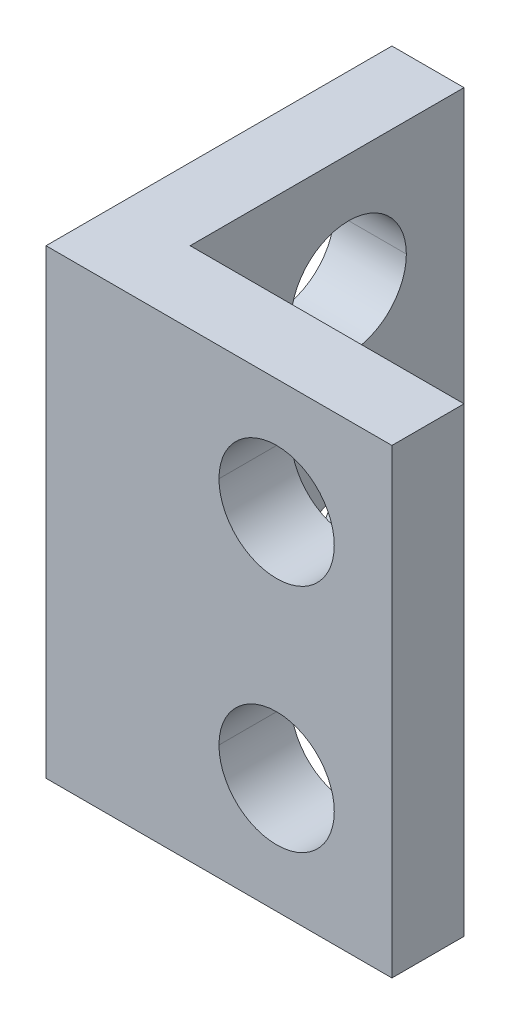
ISO-10303-21;
HEADER;
FILE_DESCRIPTION(('STEP AP214'),'2;1');
FILE_NAME('part.step','',(''),(''),'','','');
FILE_SCHEMA(('AUTOMOTIVE_DESIGN { 1 0 10303 214 1 1 1 1 }'));
ENDSEC;
DATA;
#1=APPLICATION_CONTEXT('core data for automotive mechanical design processes');
#2=APPLICATION_PROTOCOL_DEFINITION('international standard','automotive_design',2000,#1);
#3=PRODUCT_CONTEXT('',#1,'mechanical');
#4=PRODUCT('Part','Part','',(#3));
#5=PRODUCT_RELATED_PRODUCT_CATEGORY('part','',(#4));
#6=PRODUCT_DEFINITION_FORMATION('','',#4);
#7=PRODUCT_DEFINITION_CONTEXT('part definition',#1,'design');
#8=PRODUCT_DEFINITION('design','',#6,#7);
#9=PRODUCT_DEFINITION_SHAPE('','',#8);
#10=(LENGTH_UNIT() NAMED_UNIT(*) SI_UNIT(.MILLI.,.METRE.));
#11=(NAMED_UNIT(*) PLANE_ANGLE_UNIT() SI_UNIT($,.RADIAN.));
#12=(NAMED_UNIT(*) SI_UNIT($,.STERADIAN.) SOLID_ANGLE_UNIT());
#13=UNCERTAINTY_MEASURE_WITH_UNIT(LENGTH_MEASURE(1.E-05),#10,'distance_accuracy_value','');
#14=(GEOMETRIC_REPRESENTATION_CONTEXT(3) GLOBAL_UNCERTAINTY_ASSIGNED_CONTEXT((#13)) GLOBAL_UNIT_ASSIGNED_CONTEXT((#10,
#11,#12)) REPRESENTATION_CONTEXT('',''));
#15=CARTESIAN_POINT('',(0.,0.,0.));
#16=DIRECTION('',(0.,0.,1.));
#17=DIRECTION('',(1.,0.,0.));
#18=AXIS2_PLACEMENT_3D('',#15,#16,#17);
#19=CARTESIAN_POINT('',(12.,12.,-8.));
#20=DIRECTION('',(-1.,0.,0.));
#21=DIRECTION('',(0.,0.,1.));
#22=AXIS2_PLACEMENT_3D('',#19,#20,#21);
#23=CYLINDRICAL_SURFACE('',#22,2.);
#24=DIRECTION('',(-1.,0.,0.));
#25=VECTOR('',#24,1.);
#26=CARTESIAN_POINT('',(12.,12.,-10.));
#27=LINE('',#26,#25);
#28=CARTESIAN_POINT('',(2.5,12.,-10.));
#29=VERTEX_POINT('',#28);
#30=CARTESIAN_POINT('',(0.,12.,-10.));
#31=VERTEX_POINT('',#30);
#32=EDGE_CURVE('E214',#29,#31,#27,.T.);
#33=ORIENTED_EDGE('',*,*,#32,.F.);
#34=CARTESIAN_POINT('',(2.5,12.,-8.));
#35=DIRECTION('',(-1.,0.,0.));
#36=DIRECTION('',(0.,0.,1.));
#37=AXIS2_PLACEMENT_3D('',#34,#35,#36);
#38=CIRCLE('',#37,2.);
#39=CARTESIAN_POINT('',(2.5,12.,-6.));
#40=VERTEX_POINT('',#39);
#41=EDGE_CURVE('E83',#40,#29,#38,.T.);
#42=ORIENTED_EDGE('',*,*,#41,.F.);
#43=DIRECTION('',(-1.,0.,0.));
#44=VECTOR('',#43,1.);
#45=CARTESIAN_POINT('',(12.,12.,-6.));
#46=LINE('',#45,#44);
#47=CARTESIAN_POINT('',(0.,12.,-6.));
#48=VERTEX_POINT('',#47);
#49=EDGE_CURVE('E236',#40,#48,#46,.T.);
#50=ORIENTED_EDGE('',*,*,#49,.T.);
#51=CARTESIAN_POINT('',(0.,12.,-8.));
#52=DIRECTION('',(-1.,0.,0.));
#53=DIRECTION('',(0.,0.,1.));
#54=AXIS2_PLACEMENT_3D('',#51,#52,#53);
#55=CIRCLE('',#54,2.);
#56=EDGE_CURVE('E180',#48,#31,#55,.T.);
#57=ORIENTED_EDGE('',*,*,#56,.T.);
#58=EDGE_LOOP('',(#33,#42,#50,#57));
#59=FACE_BOUND('',#58,.T.);
#60=ADVANCED_FACE('F15',(#59),#23,.F.);
#61=CARTESIAN_POINT('',(8.,12.,-12.));
#62=DIRECTION('',(0.,0.,1.));
#63=DIRECTION('',(1.,0.,0.));
#64=AXIS2_PLACEMENT_3D('',#61,#62,#63);
#65=CYLINDRICAL_SURFACE('',#64,2.);
#66=DIRECTION('',(0.,0.,1.));
#67=VECTOR('',#66,1.);
#68=CARTESIAN_POINT('',(6.,12.,-12.));
#69=LINE('',#68,#67);
#70=CARTESIAN_POINT('',(6.,12.,-2.5));
#71=VERTEX_POINT('',#70);
#72=CARTESIAN_POINT('',(6.,12.,0.));
#73=VERTEX_POINT('',#72);
#74=EDGE_CURVE('E206',#71,#73,#69,.T.);
#75=ORIENTED_EDGE('',*,*,#74,.F.);
#76=CARTESIAN_POINT('',(8.,12.,-2.5));
#77=DIRECTION('',(0.,0.,1.));
#78=DIRECTION('',(-1.,0.,0.));
#79=AXIS2_PLACEMENT_3D('',#76,#77,#78);
#80=CIRCLE('',#79,2.);
#81=CARTESIAN_POINT('',(10.,12.,-2.50000000000004));
#82=VERTEX_POINT('',#81);
#83=EDGE_CURVE('E246',#82,#71,#80,.T.);
#84=ORIENTED_EDGE('',*,*,#83,.F.);
#85=DIRECTION('',(0.,0.,1.));
#86=VECTOR('',#85,1.);
#87=CARTESIAN_POINT('',(10.,12.,-12.));
#88=LINE('',#87,#86);
#89=CARTESIAN_POINT('',(10.,12.,0.));
#90=VERTEX_POINT('',#89);
#91=EDGE_CURVE('E249',#82,#90,#88,.T.);
#92=ORIENTED_EDGE('',*,*,#91,.T.);
#93=CARTESIAN_POINT('',(8.,12.,0.));
#94=DIRECTION('',(0.,0.,-1.));
#95=DIRECTION('',(-1.,0.,0.));
#96=AXIS2_PLACEMENT_3D('',#93,#94,#95);
#97=CIRCLE('',#96,2.);
#98=EDGE_CURVE('E228',#73,#90,#97,.T.);
#99=ORIENTED_EDGE('',*,*,#98,.F.);
#100=EDGE_LOOP('',(#75,#84,#92,#99));
#101=FACE_BOUND('',#100,.T.);
#102=ADVANCED_FACE('F491',(#101),#65,.F.);
#103=CARTESIAN_POINT('',(0.,16.,0.));
#104=DIRECTION('',(0.,1.,0.));
#105=DIRECTION('',(1.,0.,0.));
#106=AXIS2_PLACEMENT_3D('',#103,#104,#105);
#107=PLANE('',#106);
#108=DIRECTION('',(1.,0.,0.));
#109=VECTOR('',#108,1.);
#110=CARTESIAN_POINT('',(0.,16.,-2.5));
#111=LINE('',#110,#109);
#112=CARTESIAN_POINT('',(2.5,16.,-2.5));
#113=VERTEX_POINT('',#112);
#114=CARTESIAN_POINT('',(12.,16.,-2.50000000000005));
#115=VERTEX_POINT('',#114);
#116=EDGE_CURVE('E242',#113,#115,#111,.T.);
#117=ORIENTED_EDGE('',*,*,#116,.F.);
#118=DIRECTION('',(0.,0.,-1.));
#119=VECTOR('',#118,1.);
#120=CARTESIAN_POINT('',(2.5,16.,0.));
#121=LINE('',#120,#119);
#122=CARTESIAN_POINT('',(2.5,16.,-12.));
#123=VERTEX_POINT('',#122);
#124=EDGE_CURVE('E255',#113,#123,#121,.T.);
#125=ORIENTED_EDGE('',*,*,#124,.T.);
#126=DIRECTION('',(1.,0.,0.));
#127=VECTOR('',#126,1.);
#128=CARTESIAN_POINT('',(0.,16.,-12.));
#129=LINE('',#128,#127);
#130=CARTESIAN_POINT('',(0.,16.,-12.));
#131=VERTEX_POINT('',#130);
#132=EDGE_CURVE('E177',#131,#123,#129,.T.);
#133=ORIENTED_EDGE('',*,*,#132,.F.);
#134=DIRECTION('',(0.,0.,-1.));
#135=VECTOR('',#134,1.);
#136=CARTESIAN_POINT('',(0.,16.,0.));
#137=LINE('',#136,#135);
#138=CARTESIAN_POINT('',(0.,16.,0.));
#139=VERTEX_POINT('',#138);
#140=EDGE_CURVE('E40',#139,#131,#137,.T.);
#141=ORIENTED_EDGE('',*,*,#140,.F.);
#142=DIRECTION('',(1.,0.,0.));
#143=VECTOR('',#142,1.);
#144=CARTESIAN_POINT('',(0.,16.,0.));
#145=LINE('',#144,#143);
#146=CARTESIAN_POINT('',(12.,16.,0.));
#147=VERTEX_POINT('',#146);
#148=EDGE_CURVE('E174',#139,#147,#145,.T.);
#149=ORIENTED_EDGE('',*,*,#148,.T.);
#150=DIRECTION('',(0.,0.,-1.));
#151=VECTOR('',#150,1.);
#152=CARTESIAN_POINT('',(12.,16.,0.));
#153=LINE('',#152,#151);
#154=EDGE_CURVE('E10',#147,#115,#153,.T.);
#155=ORIENTED_EDGE('',*,*,#154,.T.);
#156=EDGE_LOOP('',(#117,#125,#133,#141,#149,#155));
#157=FACE_BOUND('',#156,.T.);
#158=ADVANCED_FACE('F172',(#157),#107,.T.);
#159=CARTESIAN_POINT('',(8.,4.,-12.));
#160=DIRECTION('',(0.,0.,1.));
#161=DIRECTION('',(1.,0.,0.));
#162=AXIS2_PLACEMENT_3D('',#159,#160,#161);
#163=CYLINDRICAL_SURFACE('',#162,2.);
#164=DIRECTION('',(0.,0.,1.));
#165=VECTOR('',#164,1.);
#166=CARTESIAN_POINT('',(6.,4.,-12.));
#167=LINE('',#166,#165);
#168=CARTESIAN_POINT('',(6.,4.,-2.5));
#169=VERTEX_POINT('',#168);
#170=CARTESIAN_POINT('',(6.,4.,0.));
#171=VERTEX_POINT('',#170);
#172=EDGE_CURVE('E256',#169,#171,#167,.T.);
#173=ORIENTED_EDGE('',*,*,#172,.F.);
#174=CARTESIAN_POINT('',(8.,4.,-2.5));
#175=DIRECTION('',(0.,0.,1.));
#176=DIRECTION('',(-1.,0.,0.));
#177=AXIS2_PLACEMENT_3D('',#174,#175,#176);
#178=CIRCLE('',#177,2.);
#179=CARTESIAN_POINT('',(10.,4.,-2.50000000000004));
#180=VERTEX_POINT('',#179);
#181=EDGE_CURVE('E133',#180,#169,#178,.T.);
#182=ORIENTED_EDGE('',*,*,#181,.F.);
#183=DIRECTION('',(0.,0.,1.));
#184=VECTOR('',#183,1.);
#185=CARTESIAN_POINT('',(10.,4.,-12.));
#186=LINE('',#185,#184);
#187=CARTESIAN_POINT('',(10.,4.,0.));
#188=VERTEX_POINT('',#187);
#189=EDGE_CURVE('E229',#180,#188,#186,.T.);
#190=ORIENTED_EDGE('',*,*,#189,.T.);
#191=CARTESIAN_POINT('',(8.,4.,0.));
#192=DIRECTION('',(0.,0.,-1.));
#193=DIRECTION('',(-1.,0.,0.));
#194=AXIS2_PLACEMENT_3D('',#191,#192,#193);
#195=CIRCLE('',#194,2.);
#196=EDGE_CURVE('E122',#171,#188,#195,.T.);
#197=ORIENTED_EDGE('',*,*,#196,.F.);
#198=EDGE_LOOP('',(#173,#182,#190,#197));
#199=FACE_BOUND('',#198,.T.);
#200=ADVANCED_FACE('F499',(#199),#163,.F.);
#201=CARTESIAN_POINT('',(12.,4.,-8.));
#202=DIRECTION('',(-1.,0.,0.));
#203=DIRECTION('',(0.,0.,1.));
#204=AXIS2_PLACEMENT_3D('',#201,#202,#203);
#205=CYLINDRICAL_SURFACE('',#204,2.);
#206=DIRECTION('',(-1.,0.,0.));
#207=VECTOR('',#206,1.);
#208=CARTESIAN_POINT('',(12.,4.,-10.));
#209=LINE('',#208,#207);
#210=CARTESIAN_POINT('',(2.5,4.,-10.));
#211=VERTEX_POINT('',#210);
#212=CARTESIAN_POINT('',(0.,4.,-10.));
#213=VERTEX_POINT('',#212);
#214=EDGE_CURVE('E304',#211,#213,#209,.T.);
#215=ORIENTED_EDGE('',*,*,#214,.F.);
#216=CARTESIAN_POINT('',(2.5,4.,-8.));
#217=DIRECTION('',(-1.,0.,0.));
#218=DIRECTION('',(0.,0.,1.));
#219=AXIS2_PLACEMENT_3D('',#216,#217,#218);
#220=CIRCLE('',#219,2.);
#221=CARTESIAN_POINT('',(2.5,4.,-6.));
#222=VERTEX_POINT('',#221);
#223=EDGE_CURVE('E219',#222,#211,#220,.T.);
#224=ORIENTED_EDGE('',*,*,#223,.F.);
#225=DIRECTION('',(-1.,0.,0.));
#226=VECTOR('',#225,1.);
#227=CARTESIAN_POINT('',(12.,4.,-6.));
#228=LINE('',#227,#226);
#229=CARTESIAN_POINT('',(0.,4.,-6.));
#230=VERTEX_POINT('',#229);
#231=EDGE_CURVE('E204',#222,#230,#228,.T.);
#232=ORIENTED_EDGE('',*,*,#231,.T.);
#233=CARTESIAN_POINT('',(0.,4.,-8.));
#234=DIRECTION('',(-1.,0.,0.));
#235=DIRECTION('',(0.,0.,1.));
#236=AXIS2_PLACEMENT_3D('',#233,#234,#235);
#237=CIRCLE('',#236,2.);
#238=EDGE_CURVE('E222',#230,#213,#237,.T.);
#239=ORIENTED_EDGE('',*,*,#238,.T.);
#240=EDGE_LOOP('',(#215,#224,#232,#239));
#241=FACE_BOUND('',#240,.T.);
#242=ADVANCED_FACE('F443',(#241),#205,.F.);
#243=CARTESIAN_POINT('',(0.,0.,0.));
#244=DIRECTION('',(0.,1.,0.));
#245=DIRECTION('',(1.,0.,0.));
#246=AXIS2_PLACEMENT_3D('',#243,#244,#245);
#247=PLANE('',#246);
#248=DIRECTION('',(1.,0.,0.));
#249=VECTOR('',#248,1.);
#250=CARTESIAN_POINT('',(0.,0.,-2.5));
#251=LINE('',#250,#249);
#252=CARTESIAN_POINT('',(2.5,0.,-2.5));
#253=VERTEX_POINT('',#252);
#254=CARTESIAN_POINT('',(12.,0.,-2.50000000000005));
#255=VERTEX_POINT('',#254);
#256=EDGE_CURVE('E243',#253,#255,#251,.T.);
#257=ORIENTED_EDGE('',*,*,#256,.T.);
#258=DIRECTION('',(0.,0.,-1.));
#259=VECTOR('',#258,1.);
#260=CARTESIAN_POINT('',(12.,0.,0.));
#261=LINE('',#260,#259);
#262=CARTESIAN_POINT('',(12.,0.,0.));
#263=VERTEX_POINT('',#262);
#264=EDGE_CURVE('E26',#263,#255,#261,.T.);
#265=ORIENTED_EDGE('',*,*,#264,.F.);
#266=DIRECTION('',(1.,0.,0.));
#267=VECTOR('',#266,1.);
#268=CARTESIAN_POINT('',(0.,0.,0.));
#269=LINE('',#268,#267);
#270=CARTESIAN_POINT('',(0.,0.,0.));
#271=VERTEX_POINT('',#270);
#272=EDGE_CURVE('E200',#271,#263,#269,.T.);
#273=ORIENTED_EDGE('',*,*,#272,.F.);
#274=DIRECTION('',(0.,0.,-1.));
#275=VECTOR('',#274,1.);
#276=CARTESIAN_POINT('',(0.,0.,0.));
#277=LINE('',#276,#275);
#278=CARTESIAN_POINT('',(0.,0.,-12.));
#279=VERTEX_POINT('',#278);
#280=EDGE_CURVE('E181',#271,#279,#277,.T.);
#281=ORIENTED_EDGE('',*,*,#280,.T.);
#282=DIRECTION('',(1.,0.,0.));
#283=VECTOR('',#282,1.);
#284=CARTESIAN_POINT('',(0.,0.,-12.));
#285=LINE('',#284,#283);
#286=CARTESIAN_POINT('',(2.5,0.,-12.));
#287=VERTEX_POINT('',#286);
#288=EDGE_CURVE('E215',#279,#287,#285,.T.);
#289=ORIENTED_EDGE('',*,*,#288,.T.);
#290=DIRECTION('',(0.,0.,-1.));
#291=VECTOR('',#290,1.);
#292=CARTESIAN_POINT('',(2.5,0.,0.));
#293=LINE('',#292,#291);
#294=EDGE_CURVE('E293',#253,#287,#293,.T.);
#295=ORIENTED_EDGE('',*,*,#294,.F.);
#296=EDGE_LOOP('',(#257,#265,#273,#281,#289,#295));
#297=FACE_BOUND('',#296,.T.);
#298=ADVANCED_FACE('F17',(#297),#247,.F.);
#299=CARTESIAN_POINT('',(12.,8.,0.));
#300=DIRECTION('',(-1.,0.,0.));
#301=DIRECTION('',(0.,1.,0.));
#302=AXIS2_PLACEMENT_3D('',#299,#300,#301);
#303=PLANE('',#302);
#304=ORIENTED_EDGE('',*,*,#264,.T.);
#305=DIRECTION('',(0.,-1.,0.));
#306=VECTOR('',#305,1.);
#307=CARTESIAN_POINT('',(12.,8.,-2.50000000000005));
#308=LINE('',#307,#306);
#309=EDGE_CURVE('E268',#115,#255,#308,.T.);
#310=ORIENTED_EDGE('',*,*,#309,.F.);
#311=ORIENTED_EDGE('',*,*,#154,.F.);
#312=DIRECTION('',(0.,-1.,0.));
#313=VECTOR('',#312,1.);
#314=CARTESIAN_POINT('',(12.,8.,0.));
#315=LINE('',#314,#313);
#316=EDGE_CURVE('E192',#147,#263,#315,.T.);
#317=ORIENTED_EDGE('',*,*,#316,.T.);
#318=EDGE_LOOP('',(#304,#310,#311,#317));
#319=FACE_BOUND('',#318,.T.);
#320=ADVANCED_FACE('F384',(#319),#303,.F.);
#321=CARTESIAN_POINT('',(0.,8.,0.));
#322=DIRECTION('',(-1.,0.,0.));
#323=DIRECTION('',(0.,0.,1.));
#324=AXIS2_PLACEMENT_3D('',#321,#322,#323);
#325=PLANE('',#324);
#326=ORIENTED_EDGE('',*,*,#238,.F.);
#327=CARTESIAN_POINT('',(0.,4.,-8.));
#328=DIRECTION('',(-1.,0.,0.));
#329=DIRECTION('',(0.,0.,1.));
#330=AXIS2_PLACEMENT_3D('',#327,#328,#329);
#331=CIRCLE('',#330,2.);
#332=EDGE_CURVE('E300',#213,#230,#331,.T.);
#333=ORIENTED_EDGE('',*,*,#332,.F.);
#334=EDGE_LOOP('',(#326,#333));
#335=FACE_BOUND('',#334,.T.);
#336=ORIENTED_EDGE('',*,*,#56,.F.);
#337=CARTESIAN_POINT('',(0.,12.,-8.));
#338=DIRECTION('',(-1.,0.,0.));
#339=DIRECTION('',(0.,0.,1.));
#340=AXIS2_PLACEMENT_3D('',#337,#338,#339);
#341=CIRCLE('',#340,2.);
#342=EDGE_CURVE('E263',#31,#48,#341,.T.);
#343=ORIENTED_EDGE('',*,*,#342,.F.);
#344=EDGE_LOOP('',(#336,#343));
#345=FACE_BOUND('',#344,.T.);
#346=ORIENTED_EDGE('',*,*,#280,.F.);
#347=DIRECTION('',(0.,-1.,0.));
#348=VECTOR('',#347,1.);
#349=CARTESIAN_POINT('',(0.,8.,0.));
#350=LINE('',#349,#348);
#351=EDGE_CURVE('E184',#139,#271,#350,.T.);
#352=ORIENTED_EDGE('',*,*,#351,.F.);
#353=ORIENTED_EDGE('',*,*,#140,.T.);
#354=DIRECTION('',(0.,-1.,0.));
#355=VECTOR('',#354,1.);
#356=CARTESIAN_POINT('',(0.,8.,-12.));
#357=LINE('',#356,#355);
#358=EDGE_CURVE('E218',#131,#279,#357,.T.);
#359=ORIENTED_EDGE('',*,*,#358,.T.);
#360=EDGE_LOOP('',(#346,#352,#353,#359));
#361=FACE_BOUND('',#360,.T.);
#362=ADVANCED_FACE('F185',(#335,#345,#361),#325,.T.);
#363=CARTESIAN_POINT('',(0.,8.,-12.));
#364=DIRECTION('',(0.,0.,-1.));
#365=DIRECTION('',(0.,-1.,0.));
#366=AXIS2_PLACEMENT_3D('',#363,#364,#365);
#367=PLANE('',#366);
#368=ORIENTED_EDGE('',*,*,#288,.F.);
#369=ORIENTED_EDGE('',*,*,#358,.F.);
#370=ORIENTED_EDGE('',*,*,#132,.T.);
#371=DIRECTION('',(0.,-1.,0.));
#372=VECTOR('',#371,1.);
#373=CARTESIAN_POINT('',(2.5,8.,-12.));
#374=LINE('',#373,#372);
#375=EDGE_CURVE('E271',#123,#287,#374,.T.);
#376=ORIENTED_EDGE('',*,*,#375,.T.);
#377=EDGE_LOOP('',(#368,#369,#370,#376));
#378=FACE_BOUND('',#377,.T.);
#379=ADVANCED_FACE('F475',(#378),#367,.T.);
#380=CARTESIAN_POINT('',(2.5,8.,0.));
#381=DIRECTION('',(-1.,0.,0.));
#382=DIRECTION('',(0.,0.,1.));
#383=AXIS2_PLACEMENT_3D('',#380,#381,#382);
#384=PLANE('',#383);
#385=ORIENTED_EDGE('',*,*,#223,.T.);
#386=CARTESIAN_POINT('',(2.5,4.,-8.));
#387=DIRECTION('',(-1.,0.,0.));
#388=DIRECTION('',(0.,0.,1.));
#389=AXIS2_PLACEMENT_3D('',#386,#387,#388);
#390=CIRCLE('',#389,2.);
#391=EDGE_CURVE('E232',#211,#222,#390,.T.);
#392=ORIENTED_EDGE('',*,*,#391,.T.);
#393=EDGE_LOOP('',(#385,#392));
#394=FACE_BOUND('',#393,.T.);
#395=ORIENTED_EDGE('',*,*,#41,.T.);
#396=CARTESIAN_POINT('',(2.5,12.,-8.));
#397=DIRECTION('',(-1.,0.,0.));
#398=DIRECTION('',(0.,0.,1.));
#399=AXIS2_PLACEMENT_3D('',#396,#397,#398);
#400=CIRCLE('',#399,2.);
#401=EDGE_CURVE('E211',#29,#40,#400,.T.);
#402=ORIENTED_EDGE('',*,*,#401,.T.);
#403=EDGE_LOOP('',(#395,#402));
#404=FACE_BOUND('',#403,.T.);
#405=ORIENTED_EDGE('',*,*,#294,.T.);
#406=ORIENTED_EDGE('',*,*,#375,.F.);
#407=ORIENTED_EDGE('',*,*,#124,.F.);
#408=DIRECTION('',(0.,-1.,0.));
#409=VECTOR('',#408,1.);
#410=CARTESIAN_POINT('',(2.5,8.,-2.5));
#411=LINE('',#410,#409);
#412=EDGE_CURVE('E238',#113,#253,#411,.T.);
#413=ORIENTED_EDGE('',*,*,#412,.T.);
#414=EDGE_LOOP('',(#405,#406,#407,#413));
#415=FACE_BOUND('',#414,.T.);
#416=ADVANCED_FACE('F320',(#394,#404,#415),#384,.F.);
#417=CARTESIAN_POINT('',(0.,8.,0.));
#418=DIRECTION('',(0.,0.,-1.));
#419=DIRECTION('',(-1.,0.,0.));
#420=AXIS2_PLACEMENT_3D('',#417,#418,#419);
#421=PLANE('',#420);
#422=CARTESIAN_POINT('',(8.,12.,0.));
#423=DIRECTION('',(0.,0.,-1.));
#424=DIRECTION('',(-1.,0.,0.));
#425=AXIS2_PLACEMENT_3D('',#422,#423,#424);
#426=CIRCLE('',#425,2.);
#427=EDGE_CURVE('E209',#90,#73,#426,.T.);
#428=ORIENTED_EDGE('',*,*,#427,.T.);
#429=ORIENTED_EDGE('',*,*,#98,.T.);
#430=EDGE_LOOP('',(#428,#429));
#431=FACE_BOUND('',#430,.T.);
#432=CARTESIAN_POINT('',(8.,4.,0.));
#433=DIRECTION('',(0.,0.,-1.));
#434=DIRECTION('',(-1.,0.,0.));
#435=AXIS2_PLACEMENT_3D('',#432,#433,#434);
#436=CIRCLE('',#435,2.);
#437=EDGE_CURVE('E233',#188,#171,#436,.T.);
#438=ORIENTED_EDGE('',*,*,#437,.T.);
#439=ORIENTED_EDGE('',*,*,#196,.T.);
#440=EDGE_LOOP('',(#438,#439));
#441=FACE_BOUND('',#440,.T.);
#442=ORIENTED_EDGE('',*,*,#272,.T.);
#443=ORIENTED_EDGE('',*,*,#316,.F.);
#444=ORIENTED_EDGE('',*,*,#148,.F.);
#445=ORIENTED_EDGE('',*,*,#351,.T.);
#446=EDGE_LOOP('',(#442,#443,#444,#445));
#447=FACE_BOUND('',#446,.T.);
#448=ADVANCED_FACE('F191',(#431,#441,#447),#421,.F.);
#449=CARTESIAN_POINT('',(0.,8.,-2.5));
#450=DIRECTION('',(0.,0.,-1.));
#451=DIRECTION('',(-1.,0.,0.));
#452=AXIS2_PLACEMENT_3D('',#449,#450,#451);
#453=PLANE('',#452);
#454=ORIENTED_EDGE('',*,*,#83,.T.);
#455=CARTESIAN_POINT('',(8.,12.,-2.5));
#456=DIRECTION('',(0.,0.,1.));
#457=DIRECTION('',(-1.,0.,0.));
#458=AXIS2_PLACEMENT_3D('',#455,#456,#457);
#459=CIRCLE('',#458,2.);
#460=EDGE_CURVE('E210',#71,#82,#459,.T.);
#461=ORIENTED_EDGE('',*,*,#460,.T.);
#462=EDGE_LOOP('',(#454,#461));
#463=FACE_BOUND('',#462,.T.);
#464=ORIENTED_EDGE('',*,*,#181,.T.);
#465=CARTESIAN_POINT('',(8.,4.,-2.5));
#466=DIRECTION('',(0.,0.,1.));
#467=DIRECTION('',(-1.,0.,0.));
#468=AXIS2_PLACEMENT_3D('',#465,#466,#467);
#469=CIRCLE('',#468,2.);
#470=EDGE_CURVE('E19',#169,#180,#469,.T.);
#471=ORIENTED_EDGE('',*,*,#470,.T.);
#472=EDGE_LOOP('',(#464,#471));
#473=FACE_BOUND('',#472,.T.);
#474=ORIENTED_EDGE('',*,*,#256,.F.);
#475=ORIENTED_EDGE('',*,*,#412,.F.);
#476=ORIENTED_EDGE('',*,*,#116,.T.);
#477=ORIENTED_EDGE('',*,*,#309,.T.);
#478=EDGE_LOOP('',(#474,#475,#476,#477));
#479=FACE_BOUND('',#478,.T.);
#480=ADVANCED_FACE('F386',(#463,#473,#479),#453,.T.);
#481=CARTESIAN_POINT('',(12.,4.,-8.));
#482=DIRECTION('',(-1.,0.,0.));
#483=DIRECTION('',(0.,0.,1.));
#484=AXIS2_PLACEMENT_3D('',#481,#482,#483);
#485=CYLINDRICAL_SURFACE('',#484,2.);
#486=ORIENTED_EDGE('',*,*,#391,.F.);
#487=ORIENTED_EDGE('',*,*,#214,.T.);
#488=ORIENTED_EDGE('',*,*,#332,.T.);
#489=ORIENTED_EDGE('',*,*,#231,.F.);
#490=EDGE_LOOP('',(#486,#487,#488,#489));
#491=FACE_BOUND('',#490,.T.);
#492=ADVANCED_FACE('F324',(#491),#485,.F.);
#493=CARTESIAN_POINT('',(8.,4.,-12.));
#494=DIRECTION('',(0.,0.,1.));
#495=DIRECTION('',(1.,0.,0.));
#496=AXIS2_PLACEMENT_3D('',#493,#494,#495);
#497=CYLINDRICAL_SURFACE('',#496,2.);
#498=ORIENTED_EDGE('',*,*,#470,.F.);
#499=ORIENTED_EDGE('',*,*,#172,.T.);
#500=ORIENTED_EDGE('',*,*,#437,.F.);
#501=ORIENTED_EDGE('',*,*,#189,.F.);
#502=EDGE_LOOP('',(#498,#499,#500,#501));
#503=FACE_BOUND('',#502,.T.);
#504=ADVANCED_FACE('F459',(#503),#497,.F.);
#505=CARTESIAN_POINT('',(8.,12.,-12.));
#506=DIRECTION('',(0.,0.,1.));
#507=DIRECTION('',(1.,0.,0.));
#508=AXIS2_PLACEMENT_3D('',#505,#506,#507);
#509=CYLINDRICAL_SURFACE('',#508,2.);
#510=ORIENTED_EDGE('',*,*,#460,.F.);
#511=ORIENTED_EDGE('',*,*,#74,.T.);
#512=ORIENTED_EDGE('',*,*,#427,.F.);
#513=ORIENTED_EDGE('',*,*,#91,.F.);
#514=EDGE_LOOP('',(#510,#511,#512,#513));
#515=FACE_BOUND('',#514,.T.);
#516=ADVANCED_FACE('F451',(#515),#509,.F.);
#517=CARTESIAN_POINT('',(12.,12.,-8.));
#518=DIRECTION('',(-1.,0.,0.));
#519=DIRECTION('',(0.,0.,1.));
#520=AXIS2_PLACEMENT_3D('',#517,#518,#519);
#521=CYLINDRICAL_SURFACE('',#520,2.);
#522=ORIENTED_EDGE('',*,*,#401,.F.);
#523=ORIENTED_EDGE('',*,*,#32,.T.);
#524=ORIENTED_EDGE('',*,*,#342,.T.);
#525=ORIENTED_EDGE('',*,*,#49,.F.);
#526=EDGE_LOOP('',(#522,#523,#524,#525));
#527=FACE_BOUND('',#526,.T.);
#528=ADVANCED_FACE('F447',(#527),#521,.F.);
#529=CLOSED_SHELL('',(#60,#102,#158,#200,#242,#298,#320,#362,#379,#416,#448,#480,#492,#504,#516,#528));
#530=MANIFOLD_SOLID_BREP('B1',#529);
#531=ADVANCED_BREP_SHAPE_REPRESENTATION('',(#18,#530),#14);
#532=SHAPE_DEFINITION_REPRESENTATION(#9,#531);
ENDSEC;
END-ISO-10303-21;
